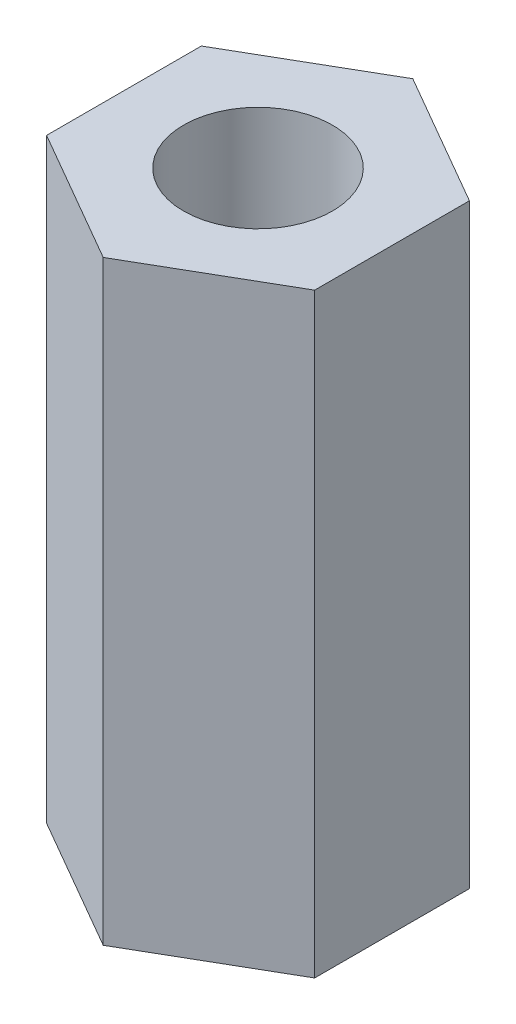
ISO-10303-21;
HEADER;
FILE_DESCRIPTION(('STEP AP214'),'2;1');
FILE_NAME('part.step','',(''),(''),'','','');
FILE_SCHEMA(('AUTOMOTIVE_DESIGN { 1 0 10303 214 1 1 1 1 }'));
ENDSEC;
DATA;
#1=APPLICATION_CONTEXT('core data for automotive mechanical design processes');
#2=APPLICATION_PROTOCOL_DEFINITION('international standard','automotive_design',2000,#1);
#3=PRODUCT_CONTEXT('',#1,'mechanical');
#4=PRODUCT('Part','Part','',(#3));
#5=PRODUCT_RELATED_PRODUCT_CATEGORY('part','',(#4));
#6=PRODUCT_DEFINITION_FORMATION('','',#4);
#7=PRODUCT_DEFINITION_CONTEXT('part definition',#1,'design');
#8=PRODUCT_DEFINITION('design','',#6,#7);
#9=PRODUCT_DEFINITION_SHAPE('','',#8);
#10=(LENGTH_UNIT() NAMED_UNIT(*) SI_UNIT(.MILLI.,.METRE.));
#11=(NAMED_UNIT(*) PLANE_ANGLE_UNIT() SI_UNIT($,.RADIAN.));
#12=(NAMED_UNIT(*) SI_UNIT($,.STERADIAN.) SOLID_ANGLE_UNIT());
#13=UNCERTAINTY_MEASURE_WITH_UNIT(LENGTH_MEASURE(1.E-05),#10,'distance_accuracy_value','');
#14=(GEOMETRIC_REPRESENTATION_CONTEXT(3) GLOBAL_UNCERTAINTY_ASSIGNED_CONTEXT((#13)) GLOBAL_UNIT_ASSIGNED_CONTEXT((#10,
#11,#12)) REPRESENTATION_CONTEXT('',''));
#15=CARTESIAN_POINT('',(0.,0.,0.));
#16=DIRECTION('',(0.,0.,1.));
#17=DIRECTION('',(1.,0.,0.));
#18=AXIS2_PLACEMENT_3D('',#15,#16,#17);
#19=CARTESIAN_POINT('',(-2.25,5.,1.29903810567666));
#20=DIRECTION('',(0.5,0.,-0.866025403784439));
#21=DIRECTION('',(-0.866025403784439,0.,-0.5));
#22=AXIS2_PLACEMENT_3D('',#19,#20,#21);
#23=PLANE('',#22);
#24=DIRECTION('',(0.866025403784439,0.,0.5));
#25=VECTOR('',#24,1.);
#26=CARTESIAN_POINT('',(-2.25,-5.,1.29903810567666));
#27=LINE('',#26,#25);
#28=CARTESIAN_POINT('',(-2.25,-5.,1.29903810567666));
#29=VERTEX_POINT('',#28);
#30=CARTESIAN_POINT('',(0.,-5.,2.59807621135332));
#31=VERTEX_POINT('',#30);
#32=EDGE_CURVE('E123',#29,#31,#27,.T.);
#33=ORIENTED_EDGE('',*,*,#32,.T.);
#34=DIRECTION('',(0.,-1.,0.));
#35=VECTOR('',#34,1.);
#36=CARTESIAN_POINT('',(0.,5.,2.59807621135332));
#37=LINE('',#36,#35);
#38=CARTESIAN_POINT('',(0.,5.,2.59807621135332));
#39=VERTEX_POINT('',#38);
#40=EDGE_CURVE('E11',#39,#31,#37,.T.);
#41=ORIENTED_EDGE('',*,*,#40,.F.);
#42=DIRECTION('',(0.866025403784439,0.,0.5));
#43=VECTOR('',#42,1.);
#44=CARTESIAN_POINT('',(-2.25,5.,1.29903810567666));
#45=LINE('',#44,#43);
#46=CARTESIAN_POINT('',(-2.25,5.,1.29903810567666));
#47=VERTEX_POINT('',#46);
#48=EDGE_CURVE('E134',#47,#39,#45,.T.);
#49=ORIENTED_EDGE('',*,*,#48,.F.);
#50=DIRECTION('',(0.,-1.,0.));
#51=VECTOR('',#50,1.);
#52=CARTESIAN_POINT('',(-2.25,5.,1.29903810567666));
#53=LINE('',#52,#51);
#54=EDGE_CURVE('E119',#47,#29,#53,.T.);
#55=ORIENTED_EDGE('',*,*,#54,.T.);
#56=EDGE_LOOP('',(#33,#41,#49,#55));
#57=FACE_BOUND('',#56,.T.);
#58=ADVANCED_FACE('F39',(#57),#23,.F.);
#59=CARTESIAN_POINT('',(0.,5.,2.59807621135332));
#60=DIRECTION('',(-0.500000000000001,0.,-0.866025403784438));
#61=DIRECTION('',(-0.866025403784438,0.,0.500000000000001));
#62=AXIS2_PLACEMENT_3D('',#59,#60,#61);
#63=PLANE('',#62);
#64=DIRECTION('',(0.866025403784438,0.,-0.500000000000001));
#65=VECTOR('',#64,1.);
#66=CARTESIAN_POINT('',(0.,-5.,2.59807621135332));
#67=LINE('',#66,#65);
#68=CARTESIAN_POINT('',(2.25,-5.,1.29903810567666));
#69=VERTEX_POINT('',#68);
#70=EDGE_CURVE('E126',#31,#69,#67,.T.);
#71=ORIENTED_EDGE('',*,*,#70,.T.);
#72=DIRECTION('',(0.,-1.,0.));
#73=VECTOR('',#72,1.);
#74=CARTESIAN_POINT('',(2.25,5.,1.29903810567666));
#75=LINE('',#74,#73);
#76=CARTESIAN_POINT('',(2.25,5.,1.29903810567666));
#77=VERTEX_POINT('',#76);
#78=EDGE_CURVE('E47',#77,#69,#75,.T.);
#79=ORIENTED_EDGE('',*,*,#78,.F.);
#80=DIRECTION('',(0.866025403784438,0.,-0.500000000000001));
#81=VECTOR('',#80,1.);
#82=CARTESIAN_POINT('',(0.,5.,2.59807621135332));
#83=LINE('',#82,#81);
#84=EDGE_CURVE('E92',#39,#77,#83,.T.);
#85=ORIENTED_EDGE('',*,*,#84,.F.);
#86=ORIENTED_EDGE('',*,*,#40,.T.);
#87=EDGE_LOOP('',(#71,#79,#85,#86));
#88=FACE_BOUND('',#87,.T.);
#89=ADVANCED_FACE('F159',(#88),#63,.F.);
#90=CARTESIAN_POINT('',(2.25,5.,1.29903810567666));
#91=DIRECTION('',(-1.,0.,0.));
#92=DIRECTION('',(0.,0.,1.));
#93=AXIS2_PLACEMENT_3D('',#90,#91,#92);
#94=PLANE('',#93);
#95=DIRECTION('',(0.,0.,-1.));
#96=VECTOR('',#95,1.);
#97=CARTESIAN_POINT('',(2.25,-5.,1.29903810567666));
#98=LINE('',#97,#96);
#99=CARTESIAN_POINT('',(2.25,-5.,-1.29903810567666));
#100=VERTEX_POINT('',#99);
#101=EDGE_CURVE('E129',#69,#100,#98,.T.);
#102=ORIENTED_EDGE('',*,*,#101,.T.);
#103=DIRECTION('',(0.,-1.,0.));
#104=VECTOR('',#103,1.);
#105=CARTESIAN_POINT('',(2.25,5.,-1.29903810567666));
#106=LINE('',#105,#104);
#107=CARTESIAN_POINT('',(2.25,5.,-1.29903810567666));
#108=VERTEX_POINT('',#107);
#109=EDGE_CURVE('E114',#108,#100,#106,.T.);
#110=ORIENTED_EDGE('',*,*,#109,.F.);
#111=DIRECTION('',(0.,0.,-1.));
#112=VECTOR('',#111,1.);
#113=CARTESIAN_POINT('',(2.25,5.,1.29903810567666));
#114=LINE('',#113,#112);
#115=EDGE_CURVE('E105',#77,#108,#114,.T.);
#116=ORIENTED_EDGE('',*,*,#115,.F.);
#117=ORIENTED_EDGE('',*,*,#78,.T.);
#118=EDGE_LOOP('',(#102,#110,#116,#117));
#119=FACE_BOUND('',#118,.T.);
#120=ADVANCED_FACE('F140',(#119),#94,.F.);
#121=CARTESIAN_POINT('',(2.25,5.,-1.29903810567666));
#122=DIRECTION('',(-0.5,0.,0.866025403784439));
#123=DIRECTION('',(0.866025403784439,0.,0.5));
#124=AXIS2_PLACEMENT_3D('',#121,#122,#123);
#125=PLANE('',#124);
#126=DIRECTION('',(-0.866025403784439,0.,-0.5));
#127=VECTOR('',#126,1.);
#128=CARTESIAN_POINT('',(2.25,-5.,-1.29903810567666));
#129=LINE('',#128,#127);
#130=CARTESIAN_POINT('',(0.,-5.,-2.59807621135332));
#131=VERTEX_POINT('',#130);
#132=EDGE_CURVE('E113',#100,#131,#129,.T.);
#133=ORIENTED_EDGE('',*,*,#132,.T.);
#134=DIRECTION('',(0.,-1.,0.));
#135=VECTOR('',#134,1.);
#136=CARTESIAN_POINT('',(0.,5.,-2.59807621135332));
#137=LINE('',#136,#135);
#138=CARTESIAN_POINT('',(0.,5.,-2.59807621135332));
#139=VERTEX_POINT('',#138);
#140=EDGE_CURVE('E110',#139,#131,#137,.T.);
#141=ORIENTED_EDGE('',*,*,#140,.F.);
#142=DIRECTION('',(-0.866025403784439,0.,-0.5));
#143=VECTOR('',#142,1.);
#144=CARTESIAN_POINT('',(2.25,5.,-1.29903810567666));
#145=LINE('',#144,#143);
#146=EDGE_CURVE('E99',#108,#139,#145,.T.);
#147=ORIENTED_EDGE('',*,*,#146,.F.);
#148=ORIENTED_EDGE('',*,*,#109,.T.);
#149=EDGE_LOOP('',(#133,#141,#147,#148));
#150=FACE_BOUND('',#149,.T.);
#151=ADVANCED_FACE('F111',(#150),#125,.F.);
#152=CARTESIAN_POINT('',(0.,5.,-2.59807621135332));
#153=DIRECTION('',(0.5,0.,0.866025403784439));
#154=DIRECTION('',(0.866025403784439,0.,-0.5));
#155=AXIS2_PLACEMENT_3D('',#152,#153,#154);
#156=PLANE('',#155);
#157=DIRECTION('',(-0.866025403784439,0.,0.5));
#158=VECTOR('',#157,1.);
#159=CARTESIAN_POINT('',(0.,-5.,-2.59807621135332));
#160=LINE('',#159,#158);
#161=CARTESIAN_POINT('',(-2.25,-5.,-1.29903810567666));
#162=VERTEX_POINT('',#161);
#163=EDGE_CURVE('E78',#131,#162,#160,.T.);
#164=ORIENTED_EDGE('',*,*,#163,.T.);
#165=DIRECTION('',(0.,-1.,0.));
#166=VECTOR('',#165,1.);
#167=CARTESIAN_POINT('',(-2.25,5.,-1.29903810567666));
#168=LINE('',#167,#166);
#169=CARTESIAN_POINT('',(-2.25,5.,-1.29903810567666));
#170=VERTEX_POINT('',#169);
#171=EDGE_CURVE('E115',#170,#162,#168,.T.);
#172=ORIENTED_EDGE('',*,*,#171,.F.);
#173=DIRECTION('',(-0.866025403784439,0.,0.5));
#174=VECTOR('',#173,1.);
#175=CARTESIAN_POINT('',(0.,5.,-2.59807621135332));
#176=LINE('',#175,#174);
#177=EDGE_CURVE('E103',#139,#170,#176,.T.);
#178=ORIENTED_EDGE('',*,*,#177,.F.);
#179=ORIENTED_EDGE('',*,*,#140,.T.);
#180=EDGE_LOOP('',(#164,#172,#178,#179));
#181=FACE_BOUND('',#180,.T.);
#182=ADVANCED_FACE('F117',(#181),#156,.F.);
#183=CARTESIAN_POINT('',(-2.25,5.,-1.29903810567666));
#184=DIRECTION('',(1.,0.,0.));
#185=DIRECTION('',(0.,0.,-1.));
#186=AXIS2_PLACEMENT_3D('',#183,#184,#185);
#187=PLANE('',#186);
#188=DIRECTION('',(0.,0.,1.));
#189=VECTOR('',#188,1.);
#190=CARTESIAN_POINT('',(-2.25,-5.,-1.29903810567666));
#191=LINE('',#190,#189);
#192=EDGE_CURVE('E84',#162,#29,#191,.T.);
#193=ORIENTED_EDGE('',*,*,#192,.T.);
#194=ORIENTED_EDGE('',*,*,#54,.F.);
#195=DIRECTION('',(0.,0.,1.));
#196=VECTOR('',#195,1.);
#197=CARTESIAN_POINT('',(-2.25,5.,-1.29903810567666));
#198=LINE('',#197,#196);
#199=EDGE_CURVE('E55',#170,#47,#198,.T.);
#200=ORIENTED_EDGE('',*,*,#199,.F.);
#201=ORIENTED_EDGE('',*,*,#171,.T.);
#202=EDGE_LOOP('',(#193,#194,#200,#201));
#203=FACE_BOUND('',#202,.T.);
#204=ADVANCED_FACE('F147',(#203),#187,.F.);
#205=CARTESIAN_POINT('',(0.,5.,0.));
#206=DIRECTION('',(0.,1.,0.));
#207=DIRECTION('',(0.,0.,1.));
#208=AXIS2_PLACEMENT_3D('',#205,#206,#207);
#209=PLANE('',#208);
#210=CARTESIAN_POINT('',(0.,5.,0.));
#211=DIRECTION('',(0.,1.,0.));
#212=DIRECTION('',(0.,0.,1.));
#213=AXIS2_PLACEMENT_3D('',#210,#211,#212);
#214=CIRCLE('',#213,1.25);
#215=CARTESIAN_POINT('',(0.,5.,1.25));
#216=VERTEX_POINT('',#215);
#217=EDGE_CURVE('E254',#216,#216,#214,.T.);
#218=ORIENTED_EDGE('',*,*,#217,.F.);
#219=EDGE_LOOP('',(#218));
#220=FACE_BOUND('',#219,.T.);
#221=ORIENTED_EDGE('',*,*,#48,.T.);
#222=ORIENTED_EDGE('',*,*,#84,.T.);
#223=ORIENTED_EDGE('',*,*,#115,.T.);
#224=ORIENTED_EDGE('',*,*,#146,.T.);
#225=ORIENTED_EDGE('',*,*,#177,.T.);
#226=ORIENTED_EDGE('',*,*,#199,.T.);
#227=EDGE_LOOP('',(#221,#222,#223,#224,#225,#226));
#228=FACE_BOUND('',#227,.T.);
#229=ADVANCED_FACE('F101',(#220,#228),#209,.T.);
#230=CARTESIAN_POINT('',(0.,-5.,0.));
#231=DIRECTION('',(0.,1.,0.));
#232=DIRECTION('',(0.,0.,1.));
#233=AXIS2_PLACEMENT_3D('',#230,#231,#232);
#234=PLANE('',#233);
#235=ORIENTED_EDGE('',*,*,#32,.F.);
#236=ORIENTED_EDGE('',*,*,#192,.F.);
#237=ORIENTED_EDGE('',*,*,#163,.F.);
#238=ORIENTED_EDGE('',*,*,#132,.F.);
#239=ORIENTED_EDGE('',*,*,#101,.F.);
#240=ORIENTED_EDGE('',*,*,#70,.F.);
#241=EDGE_LOOP('',(#235,#236,#237,#238,#239,#240));
#242=FACE_BOUND('',#241,.T.);
#243=ADVANCED_FACE('F143',(#242),#234,.F.);
#244=CARTESIAN_POINT('',(0.,0.,0.));
#245=DIRECTION('',(0.,1.,0.));
#246=DIRECTION('',(0.,0.,1.));
#247=AXIS2_PLACEMENT_3D('',#244,#245,#246);
#248=CYLINDRICAL_SURFACE('',#247,1.25);
#249=CARTESIAN_POINT('',(0.,0.,0.));
#250=DIRECTION('',(0.,1.,0.));
#251=DIRECTION('',(0.,0.,1.));
#252=AXIS2_PLACEMENT_3D('',#249,#250,#251);
#253=CIRCLE('',#252,1.25);
#254=CARTESIAN_POINT('',(0.,0.,1.25));
#255=VERTEX_POINT('',#254);
#256=EDGE_CURVE('E127',#255,#255,#253,.T.);
#257=ORIENTED_EDGE('',*,*,#256,.F.);
#258=EDGE_LOOP('',(#257));
#259=FACE_BOUND('',#258,.T.);
#260=ORIENTED_EDGE('',*,*,#217,.T.);
#261=EDGE_LOOP('',(#260));
#262=FACE_BOUND('',#261,.T.);
#263=ADVANCED_FACE('F193',(#259,#262),#248,.F.);
#264=CARTESIAN_POINT('',(0.,0.,0.));
#265=DIRECTION('',(0.,1.,0.));
#266=DIRECTION('',(0.,0.,1.));
#267=AXIS2_PLACEMENT_3D('',#264,#265,#266);
#268=PLANE('',#267);
#269=ORIENTED_EDGE('',*,*,#256,.T.);
#270=EDGE_LOOP('',(#269));
#271=FACE_BOUND('',#270,.T.);
#272=ADVANCED_FACE('F208',(#271),#268,.T.);
#273=CLOSED_SHELL('',(#58,#89,#120,#151,#182,#204,#229,#243,#263,#272));
#274=MANIFOLD_SOLID_BREP('B2',#273);
#275=ADVANCED_BREP_SHAPE_REPRESENTATION('',(#18,#274),#14);
#276=SHAPE_DEFINITION_REPRESENTATION(#9,#275);
ENDSEC;
END-ISO-10303-21;
